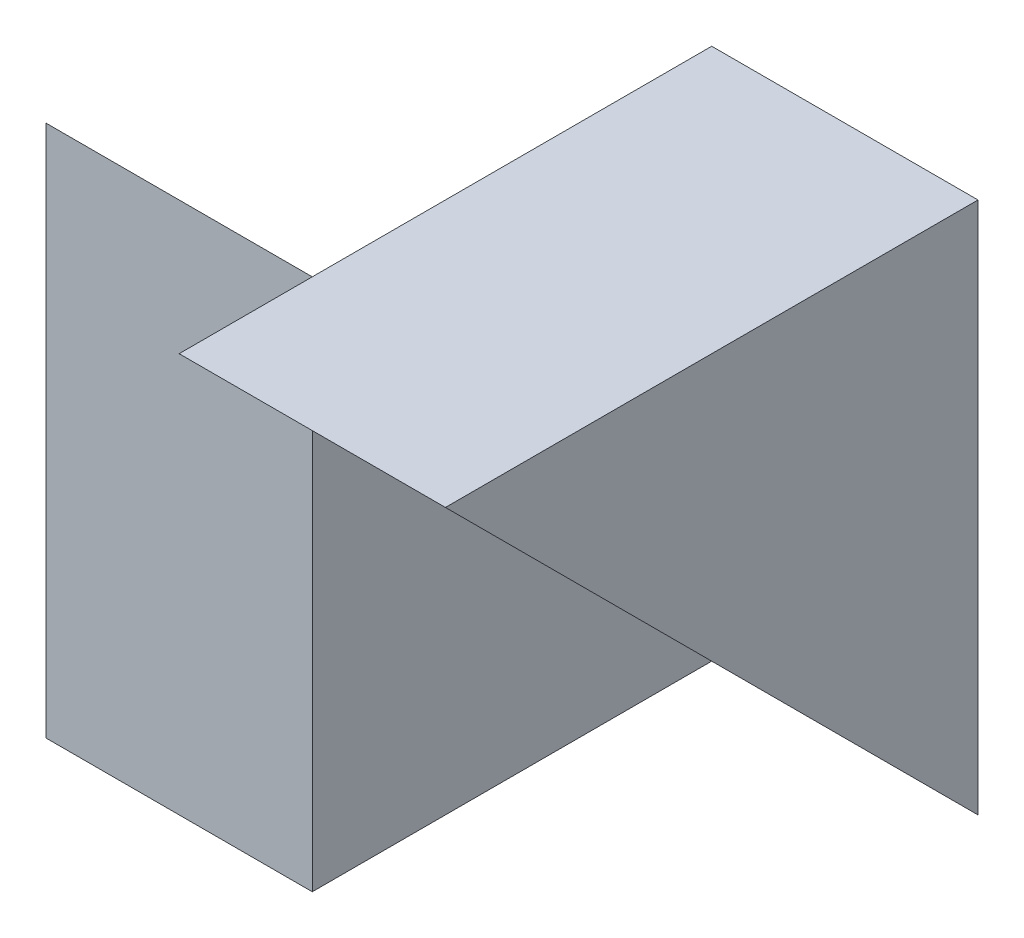
ISO-10303-21;
HEADER;
FILE_DESCRIPTION(('STEP AP214'),'2;1');
FILE_NAME('part.step','',(''),(''),'','','');
FILE_SCHEMA(('AUTOMOTIVE_DESIGN { 1 0 10303 214 1 1 1 1 }'));
ENDSEC;
DATA;
#1=APPLICATION_CONTEXT('core data for automotive mechanical design processes');
#2=APPLICATION_PROTOCOL_DEFINITION('international standard','automotive_design',2000,#1);
#3=PRODUCT_CONTEXT('',#1,'mechanical');
#4=PRODUCT('Part','Part','',(#3));
#5=PRODUCT_RELATED_PRODUCT_CATEGORY('part','',(#4));
#6=PRODUCT_DEFINITION_FORMATION('','',#4);
#7=PRODUCT_DEFINITION_CONTEXT('part definition',#1,'design');
#8=PRODUCT_DEFINITION('design','',#6,#7);
#9=PRODUCT_DEFINITION_SHAPE('','',#8);
#10=(LENGTH_UNIT() NAMED_UNIT(*) SI_UNIT(.MILLI.,.METRE.));
#11=(NAMED_UNIT(*) PLANE_ANGLE_UNIT() SI_UNIT($,.RADIAN.));
#12=(NAMED_UNIT(*) SI_UNIT($,.STERADIAN.) SOLID_ANGLE_UNIT());
#13=UNCERTAINTY_MEASURE_WITH_UNIT(LENGTH_MEASURE(1.E-05),#10,'distance_accuracy_value','');
#14=(GEOMETRIC_REPRESENTATION_CONTEXT(3) GLOBAL_UNCERTAINTY_ASSIGNED_CONTEXT((#13)) GLOBAL_UNIT_ASSIGNED_CONTEXT((#10,
#11,#12)) REPRESENTATION_CONTEXT('',''));
#15=CARTESIAN_POINT('',(0.,0.,0.));
#16=DIRECTION('',(0.,0.,1.));
#17=DIRECTION('',(1.,0.,0.));
#18=AXIS2_PLACEMENT_3D('',#15,#16,#17);
#19=CARTESIAN_POINT('',(2.,0.,0.));
#20=DIRECTION('',(0.,1.,0.));
#21=DIRECTION('',(0.,0.,1.));
#22=AXIS2_PLACEMENT_3D('',#19,#20,#21);
#23=PLANE('',#22);
#24=DIRECTION('',(0.,0.,-1.));
#25=VECTOR('',#24,1.);
#26=CARTESIAN_POINT('',(0.,0.,0.));
#27=LINE('',#26,#25);
#28=CARTESIAN_POINT('',(0.,0.,-1.));
#29=VERTEX_POINT('',#28);
#30=CARTESIAN_POINT('',(0.,0.,-4.));
#31=VERTEX_POINT('',#30);
#32=EDGE_CURVE('E88',#29,#31,#27,.T.);
#33=ORIENTED_EDGE('',*,*,#32,.F.);
#34=DIRECTION('',(1.,0.,0.));
#35=VECTOR('',#34,1.);
#36=CARTESIAN_POINT('',(-2.,0.,-1.));
#37=LINE('',#36,#35);
#38=CARTESIAN_POINT('',(-2.,0.,-1.));
#39=VERTEX_POINT('',#38);
#40=EDGE_CURVE('E138',#39,#29,#37,.T.);
#41=ORIENTED_EDGE('',*,*,#40,.F.);
#42=DIRECTION('',(0.,0.,1.));
#43=VECTOR('',#42,1.);
#44=CARTESIAN_POINT('',(-2.,0.,-4.));
#45=LINE('',#44,#43);
#46=CARTESIAN_POINT('',(-2.,0.,-4.));
#47=VERTEX_POINT('',#46);
#48=EDGE_CURVE('E128',#47,#39,#45,.T.);
#49=ORIENTED_EDGE('',*,*,#48,.F.);
#50=DIRECTION('',(-1.,0.,0.));
#51=VECTOR('',#50,1.);
#52=CARTESIAN_POINT('',(0.,0.,-4.));
#53=LINE('',#52,#51);
#54=EDGE_CURVE('E121',#31,#47,#53,.T.);
#55=ORIENTED_EDGE('',*,*,#54,.F.);
#56=EDGE_LOOP('',(#33,#41,#49,#55));
#57=FACE_BOUND('',#56,.T.);
#58=ADVANCED_FACE('F33',(#57),#23,.F.);
#59=CARTESIAN_POINT('',(2.,0.,-4.));
#60=DIRECTION('',(0.,0.,1.));
#61=DIRECTION('',(1.,0.,0.));
#62=AXIS2_PLACEMENT_3D('',#59,#60,#61);
#63=PLANE('',#62);
#64=DIRECTION('',(0.,-1.,0.));
#65=VECTOR('',#64,1.);
#66=CARTESIAN_POINT('',(0.,0.,-4.));
#67=LINE('',#66,#65);
#68=CARTESIAN_POINT('',(0.,4.,-4.));
#69=VERTEX_POINT('',#68);
#70=EDGE_CURVE('E109',#69,#31,#67,.T.);
#71=ORIENTED_EDGE('',*,*,#70,.F.);
#72=DIRECTION('',(-1.,0.,0.));
#73=VECTOR('',#72,1.);
#74=CARTESIAN_POINT('',(2.,4.,-4.));
#75=LINE('',#74,#73);
#76=CARTESIAN_POINT('',(2.,4.,-4.));
#77=VERTEX_POINT('',#76);
#78=EDGE_CURVE('E42',#77,#69,#75,.T.);
#79=ORIENTED_EDGE('',*,*,#78,.F.);
#80=DIRECTION('',(0.,1.,0.));
#81=VECTOR('',#80,1.);
#82=CARTESIAN_POINT('',(2.,0.,-4.));
#83=LINE('',#82,#81);
#84=CARTESIAN_POINT('',(2.,0.,-4.));
#85=VERTEX_POINT('',#84);
#86=EDGE_CURVE('E58',#85,#77,#83,.T.);
#87=ORIENTED_EDGE('',*,*,#86,.F.);
#88=DIRECTION('',(-1.,0.,0.));
#89=VECTOR('',#88,1.);
#90=CARTESIAN_POINT('',(2.,0.,-4.));
#91=LINE('',#90,#89);
#92=EDGE_CURVE('E11',#85,#31,#91,.T.);
#93=ORIENTED_EDGE('',*,*,#92,.T.);
#94=EDGE_LOOP('',(#71,#79,#87,#93));
#95=FACE_BOUND('',#94,.T.);
#96=ADVANCED_FACE('F130',(#95),#63,.F.);
#97=CARTESIAN_POINT('',(2.,4.,0.));
#98=DIRECTION('',(0.,-1.,0.));
#99=DIRECTION('',(0.,0.,-1.));
#100=AXIS2_PLACEMENT_3D('',#97,#98,#99);
#101=PLANE('',#100);
#102=DIRECTION('',(0.,0.,-1.));
#103=VECTOR('',#102,1.);
#104=CARTESIAN_POINT('',(0.,4.,-4.));
#105=LINE('',#104,#103);
#106=CARTESIAN_POINT('',(0.,4.,-1.));
#107=VERTEX_POINT('',#106);
#108=EDGE_CURVE('E114',#107,#69,#105,.T.);
#109=ORIENTED_EDGE('',*,*,#108,.F.);
#110=DIRECTION('',(0.,0.,1.));
#111=VECTOR('',#110,1.);
#112=CARTESIAN_POINT('',(0.,4.,0.));
#113=LINE('',#112,#111);
#114=CARTESIAN_POINT('',(0.,4.,0.));
#115=VERTEX_POINT('',#114);
#116=EDGE_CURVE('E133',#107,#115,#113,.T.);
#117=ORIENTED_EDGE('',*,*,#116,.T.);
#118=DIRECTION('',(-1.,0.,0.));
#119=VECTOR('',#118,1.);
#120=CARTESIAN_POINT('',(2.,4.,0.));
#121=LINE('',#120,#119);
#122=CARTESIAN_POINT('',(2.,4.,0.));
#123=VERTEX_POINT('',#122);
#124=EDGE_CURVE('E135',#123,#115,#121,.T.);
#125=ORIENTED_EDGE('',*,*,#124,.F.);
#126=DIRECTION('',(0.,0.,1.));
#127=VECTOR('',#126,1.);
#128=CARTESIAN_POINT('',(2.,4.,0.));
#129=LINE('',#128,#127);
#130=EDGE_CURVE('E132',#77,#123,#129,.T.);
#131=ORIENTED_EDGE('',*,*,#130,.F.);
#132=ORIENTED_EDGE('',*,*,#78,.T.);
#133=EDGE_LOOP('',(#109,#117,#125,#131,#132));
#134=FACE_BOUND('',#133,.T.);
#135=ADVANCED_FACE('F170',(#134),#101,.F.);
#136=CARTESIAN_POINT('',(2.,0.,0.));
#137=DIRECTION('',(-1.,0.,0.));
#138=DIRECTION('',(0.,0.,1.));
#139=AXIS2_PLACEMENT_3D('',#136,#137,#138);
#140=PLANE('',#139);
#141=ORIENTED_EDGE('',*,*,#130,.T.);
#142=DIRECTION('',(0.,0.707106781186548,0.707106781186548));
#143=VECTOR('',#142,1.);
#144=CARTESIAN_POINT('',(2.,2.,-2.));
#145=LINE('',#144,#143);
#146=EDGE_CURVE('E97',#85,#123,#145,.T.);
#147=ORIENTED_EDGE('',*,*,#146,.F.);
#148=ORIENTED_EDGE('',*,*,#86,.T.);
#149=EDGE_LOOP('',(#141,#147,#148));
#150=FACE_BOUND('',#149,.T.);
#151=ADVANCED_FACE('F172',(#150),#140,.F.);
#152=CARTESIAN_POINT('',(0.,0.,0.));
#153=DIRECTION('',(-1.,0.,0.));
#154=DIRECTION('',(0.,0.,1.));
#155=AXIS2_PLACEMENT_3D('',#152,#153,#154);
#156=PLANE('',#155);
#157=DIRECTION('',(0.,0.707106781186548,0.707106781186548));
#158=VECTOR('',#157,1.);
#159=CARTESIAN_POINT('',(0.,2.,-2.));
#160=LINE('',#159,#158);
#161=CARTESIAN_POINT('',(0.,3.,-1.));
#162=VERTEX_POINT('',#161);
#163=EDGE_CURVE('E96',#162,#115,#160,.T.);
#164=ORIENTED_EDGE('',*,*,#163,.T.);
#165=ORIENTED_EDGE('',*,*,#116,.F.);
#166=DIRECTION('',(0.,1.,0.));
#167=VECTOR('',#166,1.);
#168=CARTESIAN_POINT('',(0.,0.,-1.));
#169=LINE('',#168,#167);
#170=EDGE_CURVE('E36',#162,#107,#169,.T.);
#171=ORIENTED_EDGE('',*,*,#170,.F.);
#172=EDGE_LOOP('',(#164,#165,#171));
#173=FACE_BOUND('',#172,.T.);
#174=ADVANCED_FACE('F167',(#173),#156,.T.);
#175=CARTESIAN_POINT('',(-2.,0.,-1.));
#176=DIRECTION('',(0.,0.,-1.));
#177=DIRECTION('',(-1.,0.,0.));
#178=AXIS2_PLACEMENT_3D('',#175,#176,#177);
#179=PLANE('',#178);
#180=EDGE_CURVE('E91',#29,#162,#169,.T.);
#181=ORIENTED_EDGE('',*,*,#180,.T.);
#182=ORIENTED_EDGE('',*,*,#170,.T.);
#183=DIRECTION('',(1.,0.,0.));
#184=VECTOR('',#183,1.);
#185=CARTESIAN_POINT('',(-2.,4.,-1.));
#186=LINE('',#185,#184);
#187=CARTESIAN_POINT('',(-2.,4.,-1.));
#188=VERTEX_POINT('',#187);
#189=EDGE_CURVE('E124',#188,#107,#186,.T.);
#190=ORIENTED_EDGE('',*,*,#189,.F.);
#191=DIRECTION('',(0.,1.,0.));
#192=VECTOR('',#191,1.);
#193=CARTESIAN_POINT('',(-2.,0.,-1.));
#194=LINE('',#193,#192);
#195=EDGE_CURVE('E149',#39,#188,#194,.T.);
#196=ORIENTED_EDGE('',*,*,#195,.F.);
#197=ORIENTED_EDGE('',*,*,#40,.T.);
#198=EDGE_LOOP('',(#181,#182,#190,#196,#197));
#199=FACE_BOUND('',#198,.T.);
#200=ADVANCED_FACE('F164',(#199),#179,.F.);
#201=CARTESIAN_POINT('',(-2.,0.,0.));
#202=DIRECTION('',(-1.,0.,0.));
#203=DIRECTION('',(0.,0.,1.));
#204=AXIS2_PLACEMENT_3D('',#201,#202,#203);
#205=PLANE('',#204);
#206=DIRECTION('',(0.,0.8,0.6));
#207=VECTOR('',#206,1.);
#208=CARTESIAN_POINT('',(-2.,4.,-1.));
#209=LINE('',#208,#207);
#210=EDGE_CURVE('E104',#47,#188,#209,.T.);
#211=ORIENTED_EDGE('',*,*,#210,.F.);
#212=ORIENTED_EDGE('',*,*,#48,.T.);
#213=ORIENTED_EDGE('',*,*,#195,.T.);
#214=EDGE_LOOP('',(#211,#212,#213));
#215=FACE_BOUND('',#214,.T.);
#216=ADVANCED_FACE('F162',(#215),#205,.T.);
#217=CARTESIAN_POINT('',(0.,4.,-1.));
#218=DIRECTION('',(0.,-0.6,0.8));
#219=DIRECTION('',(0.,-0.8,-0.6));
#220=AXIS2_PLACEMENT_3D('',#217,#218,#219);
#221=PLANE('',#220);
#222=ORIENTED_EDGE('',*,*,#210,.T.);
#223=ORIENTED_EDGE('',*,*,#189,.T.);
#224=DIRECTION('',(0.,0.8,0.6));
#225=VECTOR('',#224,1.);
#226=CARTESIAN_POINT('',(0.,4.,-1.));
#227=LINE('',#226,#225);
#228=EDGE_CURVE('E112',#31,#107,#227,.T.);
#229=ORIENTED_EDGE('',*,*,#228,.F.);
#230=ORIENTED_EDGE('',*,*,#54,.T.);
#231=EDGE_LOOP('',(#222,#223,#229,#230));
#232=FACE_BOUND('',#231,.T.);
#233=ADVANCED_FACE('F120',(#232),#221,.F.);
#234=CARTESIAN_POINT('',(0.,0.,0.));
#235=DIRECTION('',(-1.,0.,0.));
#236=DIRECTION('',(0.,0.,1.));
#237=AXIS2_PLACEMENT_3D('',#234,#235,#236);
#238=PLANE('',#237);
#239=ORIENTED_EDGE('',*,*,#108,.T.);
#240=ORIENTED_EDGE('',*,*,#70,.T.);
#241=ORIENTED_EDGE('',*,*,#228,.T.);
#242=EDGE_LOOP('',(#239,#240,#241));
#243=FACE_BOUND('',#242,.T.);
#244=ADVANCED_FACE('F111',(#243),#238,.T.);
#245=CARTESIAN_POINT('',(0.,0.,0.));
#246=DIRECTION('',(1.,0.,0.));
#247=DIRECTION('',(0.,0.,-1.));
#248=AXIS2_PLACEMENT_3D('',#245,#246,#247);
#249=PLANE('',#248);
#250=ORIENTED_EDGE('',*,*,#180,.F.);
#251=ORIENTED_EDGE('',*,*,#32,.T.);
#252=EDGE_CURVE('E50',#31,#162,#160,.T.);
#253=ORIENTED_EDGE('',*,*,#252,.T.);
#254=EDGE_LOOP('',(#250,#251,#253));
#255=FACE_BOUND('',#254,.T.);
#256=ADVANCED_FACE('F89',(#255),#249,.T.);
#257=CARTESIAN_POINT('',(0.,2.,-2.));
#258=DIRECTION('',(0.,0.707106781186547,-0.707106781186547));
#259=DIRECTION('',(0.,0.707106781186548,0.707106781186548));
#260=AXIS2_PLACEMENT_3D('',#257,#258,#259);
#261=PLANE('',#260);
#262=ORIENTED_EDGE('',*,*,#146,.T.);
#263=ORIENTED_EDGE('',*,*,#124,.T.);
#264=ORIENTED_EDGE('',*,*,#163,.F.);
#265=ORIENTED_EDGE('',*,*,#252,.F.);
#266=ORIENTED_EDGE('',*,*,#92,.F.);
#267=EDGE_LOOP('',(#262,#263,#264,#265,#266));
#268=FACE_BOUND('',#267,.T.);
#269=ADVANCED_FACE('F101',(#268),#261,.F.);
#270=CLOSED_SHELL('',(#58,#96,#135,#151,#174,#200,#216,#233,#244,#256,#269));
#271=MANIFOLD_SOLID_BREP('B2',#270);
#272=ADVANCED_BREP_SHAPE_REPRESENTATION('',(#18,#271),#14);
#273=SHAPE_DEFINITION_REPRESENTATION(#9,#272);
ENDSEC;
END-ISO-10303-21;
